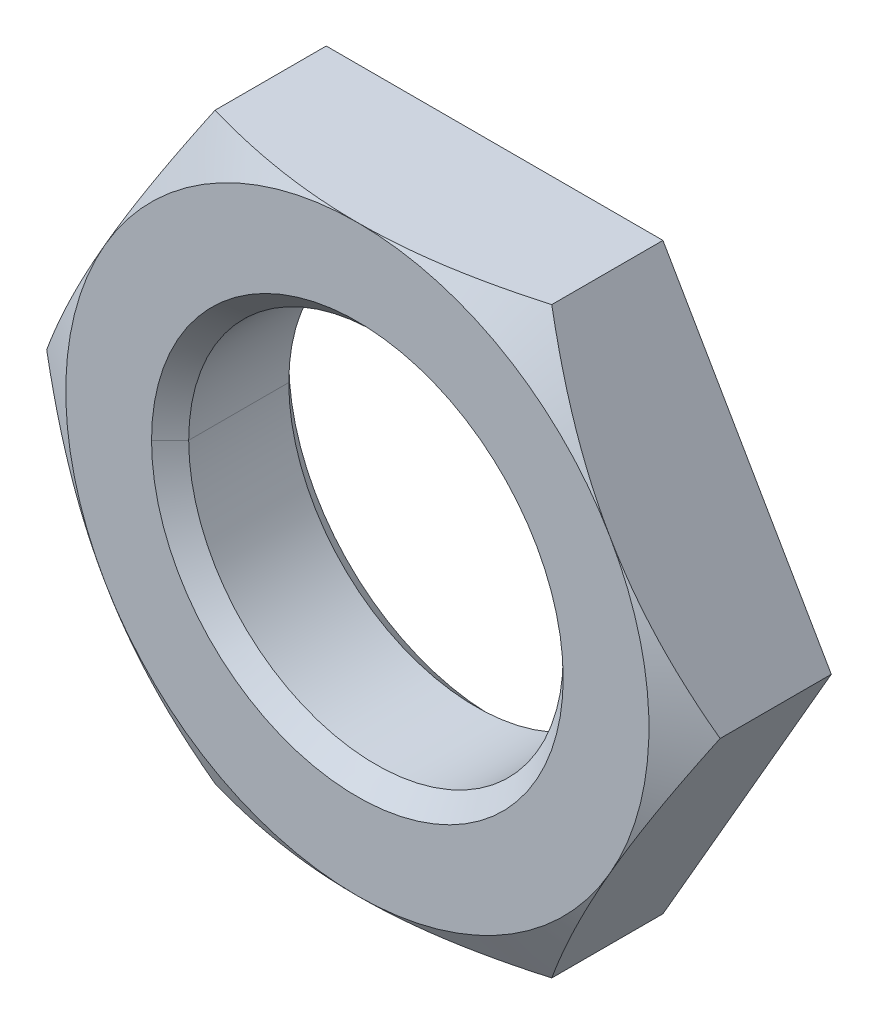
ISO-10303-21;
HEADER;
FILE_DESCRIPTION(('STEP AP214'),'2;1');
FILE_NAME('part.step','',(''),(''),'','','');
FILE_SCHEMA(('AUTOMOTIVE_DESIGN { 1 0 10303 214 1 1 1 1 }'));
ENDSEC;
DATA;
#1=APPLICATION_CONTEXT('core data for automotive mechanical design processes');
#2=APPLICATION_PROTOCOL_DEFINITION('international standard','automotive_design',2000,#1);
#3=PRODUCT_CONTEXT('',#1,'mechanical');
#4=PRODUCT('Part','Part','',(#3));
#5=PRODUCT_RELATED_PRODUCT_CATEGORY('part','',(#4));
#6=PRODUCT_DEFINITION_FORMATION('','',#4);
#7=PRODUCT_DEFINITION_CONTEXT('part definition',#1,'design');
#8=PRODUCT_DEFINITION('design','',#6,#7);
#9=PRODUCT_DEFINITION_SHAPE('','',#8);
#10=(LENGTH_UNIT() NAMED_UNIT(*) SI_UNIT(.MILLI.,.METRE.));
#11=(NAMED_UNIT(*) PLANE_ANGLE_UNIT() SI_UNIT($,.RADIAN.));
#12=(NAMED_UNIT(*) SI_UNIT($,.STERADIAN.) SOLID_ANGLE_UNIT());
#13=UNCERTAINTY_MEASURE_WITH_UNIT(LENGTH_MEASURE(1.E-05),#10,'distance_accuracy_value','');
#14=(GEOMETRIC_REPRESENTATION_CONTEXT(3) GLOBAL_UNCERTAINTY_ASSIGNED_CONTEXT((#13)) GLOBAL_UNIT_ASSIGNED_CONTEXT((#10,
#11,#12)) REPRESENTATION_CONTEXT('',''));
#15=CARTESIAN_POINT('',(0.,0.,0.));
#16=DIRECTION('',(0.,0.,1.));
#17=DIRECTION('',(1.,0.,0.));
#18=AXIS2_PLACEMENT_3D('',#15,#16,#17);
#19=CARTESIAN_POINT('',(0.,0.,4.));
#20=DIRECTION('',(0.,0.,-1.));
#21=DIRECTION('',(-0.5,-0.866025403784439,0.));
#22=AXIS2_PLACEMENT_3D('',#19,#20,#21);
#23=CONICAL_SURFACE('',#22,8.5,1.04719755119661);
#24=CARTESIAN_POINT('',(4.90736181805796,8.5002,3.24074395360206));
#25=CARTESIAN_POINT('',(5.30494305370205,7.81156909972843,3.47029568842295));
#26=CARTESIAN_POINT('',(5.71225563528683,7.10608301386154,3.66307804338871));
#27=CARTESIAN_POINT('',(6.52926879196023,5.69097471605098,3.92740251465047));
#28=CARTESIAN_POINT('',(6.94739913855476,4.96675171156286,4.));
#29=CARTESIAN_POINT('',(7.36121593216771,4.25,4.));
#30=B_SPLINE_CURVE_WITH_KNOTS('',3,(#24,#25,#26,#27,#28,#29),.UNSPECIFIED.,.F.,.F.,(4,2,4),(0.,
0.5,1.),.UNSPECIFIED.);
#31=CARTESIAN_POINT('',(4.9074772881118,8.5,3.2408106214452));
#32=VERTEX_POINT('',#31);
#33=CARTESIAN_POINT('',(7.36121593216772,4.25,4.));
#34=VERTEX_POINT('',#33);
#35=EDGE_CURVE('E11',#32,#34,#30,.T.);
#36=ORIENTED_EDGE('',*,*,#35,.F.);
#37=CARTESIAN_POINT('',(0.,8.5,4.));
#38=CARTESIAN_POINT('',(0.442406074773205,8.5,4.));
#39=CARTESIAN_POINT('',(0.894880528766715,8.5,3.97928204441104));
#40=CARTESIAN_POINT('',(2.54077283935804,8.5,3.83178715486797));
#41=CARTESIAN_POINT('',(3.74486828191635,8.5,3.5764269327898));
#42=CARTESIAN_POINT('',(4.90747728811181,8.5,3.2408106214452));
#43=B_SPLINE_CURVE_WITH_KNOTS('',3,(#37,#38,#39,#40,#41,#42),.UNSPECIFIED.,.F.,.F.,(4,2,4),(0.,
0.267721219818776,1.),.UNSPECIFIED.);
#44=CARTESIAN_POINT('',(0.,8.5,4.));
#45=VERTEX_POINT('',#44);
#46=EDGE_CURVE('E26',#45,#32,#43,.T.);
#47=ORIENTED_EDGE('',*,*,#46,.F.);
#48=CARTESIAN_POINT('',(0.,0.,4.));
#49=DIRECTION('',(0.,0.,-1.));
#50=DIRECTION('',(-1.,0.,0.));
#51=AXIS2_PLACEMENT_3D('',#48,#49,#50);
#52=CIRCLE('',#51,8.5);
#53=EDGE_CURVE('E426',#45,#34,#52,.T.);
#54=ORIENTED_EDGE('',*,*,#53,.T.);
#55=EDGE_LOOP('',(#36,#47,#54));
#56=FACE_BOUND('',#55,.T.);
#57=ADVANCED_FACE('F17',(#56),#23,.T.);
#58=CARTESIAN_POINT('',(0.,0.,4.));
#59=DIRECTION('',(0.,0.,-1.));
#60=DIRECTION('',(-1.,0.,0.));
#61=AXIS2_PLACEMENT_3D('',#58,#59,#60);
#62=PLANE('',#61);
#63=ORIENTED_EDGE('',*,*,#53,.F.);
#64=CARTESIAN_POINT('',(0.,0.,4.));
#65=DIRECTION('',(0.,0.,-1.));
#66=DIRECTION('',(-1.,0.,0.));
#67=AXIS2_PLACEMENT_3D('',#64,#65,#66);
#68=CIRCLE('',#67,8.5);
#69=CARTESIAN_POINT('',(-7.36121593216772,4.25,4.));
#70=VERTEX_POINT('',#69);
#71=EDGE_CURVE('E138',#70,#45,#68,.T.);
#72=ORIENTED_EDGE('',*,*,#71,.F.);
#73=CARTESIAN_POINT('',(0.,0.,4.));
#74=DIRECTION('',(0.,0.,-1.));
#75=DIRECTION('',(-1.,0.,0.));
#76=AXIS2_PLACEMENT_3D('',#73,#74,#75);
#77=CIRCLE('',#76,8.5);
#78=CARTESIAN_POINT('',(-7.36121593216774,-4.25,4.));
#79=VERTEX_POINT('',#78);
#80=EDGE_CURVE('E419',#79,#70,#77,.T.);
#81=ORIENTED_EDGE('',*,*,#80,.F.);
#82=CARTESIAN_POINT('',(0.,0.,4.));
#83=DIRECTION('',(0.,0.,-1.));
#84=DIRECTION('',(-1.,0.,0.));
#85=AXIS2_PLACEMENT_3D('',#82,#83,#84);
#86=CIRCLE('',#85,8.5);
#87=CARTESIAN_POINT('',(0.,-8.5,4.));
#88=VERTEX_POINT('',#87);
#89=EDGE_CURVE('E415',#88,#79,#86,.T.);
#90=ORIENTED_EDGE('',*,*,#89,.F.);
#91=CARTESIAN_POINT('',(0.,0.,4.));
#92=DIRECTION('',(0.,0.,-1.));
#93=DIRECTION('',(-1.,0.,0.));
#94=AXIS2_PLACEMENT_3D('',#91,#92,#93);
#95=CIRCLE('',#94,8.5);
#96=CARTESIAN_POINT('',(7.36121593216772,-4.25,4.));
#97=VERTEX_POINT('',#96);
#98=EDGE_CURVE('E410',#97,#88,#95,.T.);
#99=ORIENTED_EDGE('',*,*,#98,.F.);
#100=CARTESIAN_POINT('',(0.,0.,4.));
#101=DIRECTION('',(0.,0.,-1.));
#102=DIRECTION('',(-1.,0.,0.));
#103=AXIS2_PLACEMENT_3D('',#100,#101,#102);
#104=CIRCLE('',#103,8.5);
#105=EDGE_CURVE('E405',#34,#97,#104,.T.);
#106=ORIENTED_EDGE('',*,*,#105,.F.);
#107=EDGE_LOOP('',(#63,#72,#81,#90,#99,#106));
#108=FACE_BOUND('',#107,.T.);
#109=CARTESIAN_POINT('',(0.,0.,4.));
#110=DIRECTION('',(0.,0.,-1.));
#111=DIRECTION('',(-1.,0.,0.));
#112=AXIS2_PLACEMENT_3D('',#109,#110,#111);
#113=CIRCLE('',#112,6.);
#114=CARTESIAN_POINT('',(-6.,0.,4.));
#115=VERTEX_POINT('',#114);
#116=CARTESIAN_POINT('',(6.,0.,4.));
#117=VERTEX_POINT('',#116);
#118=EDGE_CURVE('E401',#115,#117,#113,.T.);
#119=ORIENTED_EDGE('',*,*,#118,.T.);
#120=CARTESIAN_POINT('',(0.,0.,4.));
#121=DIRECTION('',(0.,0.,-1.));
#122=DIRECTION('',(-1.,0.,0.));
#123=AXIS2_PLACEMENT_3D('',#120,#121,#122);
#124=CIRCLE('',#123,6.);
#125=EDGE_CURVE('E397',#117,#115,#124,.T.);
#126=ORIENTED_EDGE('',*,*,#125,.T.);
#127=EDGE_LOOP('',(#119,#126));
#128=FACE_BOUND('',#127,.T.);
#129=ADVANCED_FACE('F455',(#108,#128),#62,.F.);
#130=CARTESIAN_POINT('',(0.,0.,4.));
#131=DIRECTION('',(0.,0.,1.));
#132=DIRECTION('',(0.,1.,0.));
#133=AXIS2_PLACEMENT_3D('',#130,#131,#132);
#134=CONICAL_SURFACE('',#133,6.,0.785398163397448);
#135=DIRECTION('',(-0.707106781186548,0.,0.707106781186548));
#136=VECTOR('',#135,1.);
#137=CARTESIAN_POINT('',(-5.4585,0.,3.4585));
#138=LINE('',#137,#136);
#139=CARTESIAN_POINT('',(-5.4585,0.,3.4585));
#140=VERTEX_POINT('',#139);
#141=EDGE_CURVE('E392',#140,#115,#138,.T.);
#142=ORIENTED_EDGE('',*,*,#141,.T.);
#143=ORIENTED_EDGE('',*,*,#125,.F.);
#144=DIRECTION('',(0.707106781186548,0.,0.707106781186548));
#145=VECTOR('',#144,1.);
#146=CARTESIAN_POINT('',(5.4585,0.,3.4585));
#147=LINE('',#146,#145);
#148=CARTESIAN_POINT('',(5.4585,0.,3.4585));
#149=VERTEX_POINT('',#148);
#150=EDGE_CURVE('E387',#149,#117,#147,.T.);
#151=ORIENTED_EDGE('',*,*,#150,.F.);
#152=CARTESIAN_POINT('',(0.,0.,3.4585));
#153=DIRECTION('',(0.,0.,-1.));
#154=DIRECTION('',(-1.,0.,0.));
#155=AXIS2_PLACEMENT_3D('',#152,#153,#154);
#156=CIRCLE('',#155,5.4585);
#157=EDGE_CURVE('E383',#149,#140,#156,.T.);
#158=ORIENTED_EDGE('',*,*,#157,.T.);
#159=EDGE_LOOP('',(#142,#143,#151,#158));
#160=FACE_BOUND('',#159,.T.);
#161=ADVANCED_FACE('F545',(#160),#134,.F.);
#162=CARTESIAN_POINT('',(0.,0.,0.));
#163=DIRECTION('',(0.,0.,-1.));
#164=DIRECTION('',(-1.04482483945999E-10,1.,0.));
#165=AXIS2_PLACEMENT_3D('',#162,#163,#164);
#166=CYLINDRICAL_SURFACE('',#165,5.4585);
#167=DIRECTION('',(0.,0.,-1.));
#168=VECTOR('',#167,1.);
#169=CARTESIAN_POINT('',(5.4585,0.,3.4585));
#170=LINE('',#169,#168);
#171=CARTESIAN_POINT('',(5.4585,0.,0.5415));
#172=VERTEX_POINT('',#171);
#173=EDGE_CURVE('E379',#149,#172,#170,.T.);
#174=ORIENTED_EDGE('',*,*,#173,.T.);
#175=CARTESIAN_POINT('',(0.,0.,0.5415));
#176=DIRECTION('',(0.,0.,-1.));
#177=DIRECTION('',(-1.,0.,0.));
#178=AXIS2_PLACEMENT_3D('',#175,#176,#177);
#179=CIRCLE('',#178,5.4585);
#180=CARTESIAN_POINT('',(-5.4585,0.,0.5415));
#181=VERTEX_POINT('',#180);
#182=EDGE_CURVE('E375',#172,#181,#179,.T.);
#183=ORIENTED_EDGE('',*,*,#182,.T.);
#184=DIRECTION('',(0.,0.,-1.));
#185=VECTOR('',#184,1.);
#186=CARTESIAN_POINT('',(-5.4585,0.,3.4585));
#187=LINE('',#186,#185);
#188=EDGE_CURVE('E370',#140,#181,#187,.T.);
#189=ORIENTED_EDGE('',*,*,#188,.F.);
#190=ORIENTED_EDGE('',*,*,#157,.F.);
#191=EDGE_LOOP('',(#174,#183,#189,#190));
#192=FACE_BOUND('',#191,.T.);
#193=ADVANCED_FACE('F549',(#192),#166,.F.);
#194=CARTESIAN_POINT('',(0.,0.,0.));
#195=DIRECTION('',(0.,0.,-1.));
#196=DIRECTION('',(0.,-1.,0.));
#197=AXIS2_PLACEMENT_3D('',#194,#195,#196);
#198=CYLINDRICAL_SURFACE('',#197,5.4585);
#199=ORIENTED_EDGE('',*,*,#173,.F.);
#200=CARTESIAN_POINT('',(0.,0.,3.4585));
#201=DIRECTION('',(0.,0.,-1.));
#202=DIRECTION('',(-1.,0.,0.));
#203=AXIS2_PLACEMENT_3D('',#200,#201,#202);
#204=CIRCLE('',#203,5.4585);
#205=EDGE_CURVE('E365',#140,#149,#204,.T.);
#206=ORIENTED_EDGE('',*,*,#205,.F.);
#207=ORIENTED_EDGE('',*,*,#188,.T.);
#208=CARTESIAN_POINT('',(0.,0.,0.5415));
#209=DIRECTION('',(0.,0.,-1.));
#210=DIRECTION('',(-1.,0.,0.));
#211=AXIS2_PLACEMENT_3D('',#208,#209,#210);
#212=CIRCLE('',#211,5.4585);
#213=EDGE_CURVE('E360',#181,#172,#212,.T.);
#214=ORIENTED_EDGE('',*,*,#213,.T.);
#215=EDGE_LOOP('',(#199,#206,#207,#214));
#216=FACE_BOUND('',#215,.T.);
#217=ADVANCED_FACE('F555',(#216),#198,.F.);
#218=CARTESIAN_POINT('',(0.,0.,0.5415));
#219=DIRECTION('',(0.,0.,-1.));
#220=DIRECTION('',(0.,-1.,0.));
#221=AXIS2_PLACEMENT_3D('',#218,#219,#220);
#222=CONICAL_SURFACE('',#221,5.4585,0.785398163397449);
#223=DIRECTION('',(0.707106781186548,0.,-0.707106781186547));
#224=VECTOR('',#223,1.);
#225=CARTESIAN_POINT('',(5.4585,0.,0.541500000000001));
#226=LINE('',#225,#224);
#227=CARTESIAN_POINT('',(6.,0.,0.));
#228=VERTEX_POINT('',#227);
#229=EDGE_CURVE('E355',#172,#228,#226,.T.);
#230=ORIENTED_EDGE('',*,*,#229,.F.);
#231=ORIENTED_EDGE('',*,*,#213,.F.);
#232=DIRECTION('',(-0.707106781186548,0.,-0.707106781186547));
#233=VECTOR('',#232,1.);
#234=CARTESIAN_POINT('',(-5.4585,0.,0.541500000000001));
#235=LINE('',#234,#233);
#236=CARTESIAN_POINT('',(-6.,0.,0.));
#237=VERTEX_POINT('',#236);
#238=EDGE_CURVE('E351',#181,#237,#235,.T.);
#239=ORIENTED_EDGE('',*,*,#238,.T.);
#240=CARTESIAN_POINT('',(0.,0.,0.));
#241=DIRECTION('',(0.,0.,-1.));
#242=DIRECTION('',(-1.,0.,0.));
#243=AXIS2_PLACEMENT_3D('',#240,#241,#242);
#244=CIRCLE('',#243,6.);
#245=EDGE_CURVE('E347',#237,#228,#244,.T.);
#246=ORIENTED_EDGE('',*,*,#245,.T.);
#247=EDGE_LOOP('',(#230,#231,#239,#246));
#248=FACE_BOUND('',#247,.T.);
#249=ADVANCED_FACE('F559',(#248),#222,.F.);
#250=CARTESIAN_POINT('',(0.,9.8149545762236,0.));
#251=DIRECTION('',(0.,0.,1.));
#252=DIRECTION('',(1.,0.,0.));
#253=AXIS2_PLACEMENT_3D('',#250,#251,#252);
#254=PLANE('',#253);
#255=CARTESIAN_POINT('',(0.,0.,0.));
#256=DIRECTION('',(0.,0.,-1.));
#257=DIRECTION('',(-1.,0.,0.));
#258=AXIS2_PLACEMENT_3D('',#255,#256,#257);
#259=CIRCLE('',#258,6.);
#260=EDGE_CURVE('E342',#228,#237,#259,.T.);
#261=ORIENTED_EDGE('',*,*,#260,.F.);
#262=ORIENTED_EDGE('',*,*,#245,.F.);
#263=EDGE_LOOP('',(#261,#262));
#264=FACE_BOUND('',#263,.T.);
#265=DIRECTION('',(0.499999999999999,0.866025403784439,0.));
#266=VECTOR('',#265,1.);
#267=CARTESIAN_POINT('',(-9.8149545762236,0.,0.));
#268=LINE('',#267,#266);
#269=CARTESIAN_POINT('',(-9.8149545762236,0.,0.));
#270=VERTEX_POINT('',#269);
#271=CARTESIAN_POINT('',(-4.9074772881118,8.5,0.));
#272=VERTEX_POINT('',#271);
#273=EDGE_CURVE('E338',#270,#272,#268,.T.);
#274=ORIENTED_EDGE('',*,*,#273,.T.);
#275=DIRECTION('',(-1.,0.,0.));
#276=VECTOR('',#275,1.);
#277=CARTESIAN_POINT('',(0.,8.5,0.));
#278=LINE('',#277,#276);
#279=CARTESIAN_POINT('',(4.9074772881118,8.5,0.));
#280=VERTEX_POINT('',#279);
#281=EDGE_CURVE('E118',#280,#272,#278,.T.);
#282=ORIENTED_EDGE('',*,*,#281,.F.);
#283=DIRECTION('',(0.499999999999999,-0.866025403784439,0.));
#284=VECTOR('',#283,1.);
#285=CARTESIAN_POINT('',(4.9074772881118,8.5,0.));
#286=LINE('',#285,#284);
#287=CARTESIAN_POINT('',(9.8149545762236,0.,0.));
#288=VERTEX_POINT('',#287);
#289=EDGE_CURVE('E331',#280,#288,#286,.T.);
#290=ORIENTED_EDGE('',*,*,#289,.T.);
#291=DIRECTION('',(-0.499999999999999,-0.866025403784439,0.));
#292=VECTOR('',#291,1.);
#293=CARTESIAN_POINT('',(9.8149545762236,0.,0.));
#294=LINE('',#293,#292);
#295=CARTESIAN_POINT('',(4.9074772881118,-8.5,0.));
#296=VERTEX_POINT('',#295);
#297=EDGE_CURVE('E327',#288,#296,#294,.T.);
#298=ORIENTED_EDGE('',*,*,#297,.T.);
#299=DIRECTION('',(-1.,0.,0.));
#300=VECTOR('',#299,1.);
#301=CARTESIAN_POINT('',(4.9074772881118,-8.5,0.));
#302=LINE('',#301,#300);
#303=CARTESIAN_POINT('',(-4.9074772881118,-8.5,0.));
#304=VERTEX_POINT('',#303);
#305=EDGE_CURVE('E323',#296,#304,#302,.T.);
#306=ORIENTED_EDGE('',*,*,#305,.T.);
#307=DIRECTION('',(-0.499999999999999,0.866025403784439,0.));
#308=VECTOR('',#307,1.);
#309=CARTESIAN_POINT('',(-4.9074772881118,-8.5,0.));
#310=LINE('',#309,#308);
#311=EDGE_CURVE('E321',#304,#270,#310,.T.);
#312=ORIENTED_EDGE('',*,*,#311,.T.);
#313=EDGE_LOOP('',(#274,#282,#290,#298,#306,#312));
#314=FACE_BOUND('',#313,.T.);
#315=ADVANCED_FACE('F507',(#264,#314),#254,.F.);
#316=CARTESIAN_POINT('',(-4.9074772881118,-8.5,4.));
#317=DIRECTION('',(-0.866025403784439,-0.499999999999999,0.));
#318=DIRECTION('',(0.499999999999999,-0.866025403784439,0.));
#319=AXIS2_PLACEMENT_3D('',#316,#317,#318);
#320=PLANE('',#319);
#321=CARTESIAN_POINT('',(-4.90736181805796,-8.5002,3.24074395360206));
#322=CARTESIAN_POINT('',(-5.30494305370205,-7.81156909972843,3.47029568842295));
#323=CARTESIAN_POINT('',(-5.71225563528683,-7.10608301386154,3.66307804338871));
#324=CARTESIAN_POINT('',(-6.52926879196023,-5.69097471605097,3.92740251465047));
#325=CARTESIAN_POINT('',(-6.94739913855477,-4.96675171156285,4.));
#326=CARTESIAN_POINT('',(-7.36121593216771,-4.24999999999999,4.));
#327=B_SPLINE_CURVE_WITH_KNOTS('',3,(#321,#322,#323,#324,#325,#326),.UNSPECIFIED.,.F.,.F.,(4,2,
4),(0.,0.5,1.),.UNSPECIFIED.);
#328=CARTESIAN_POINT('',(-4.9074772881118,-8.5,3.2408106214452));
#329=VERTEX_POINT('',#328);
#330=EDGE_CURVE('E319',#329,#79,#327,.T.);
#331=ORIENTED_EDGE('',*,*,#330,.T.);
#332=CARTESIAN_POINT('',(-7.36121593216771,-4.24999999999999,4.));
#333=CARTESIAN_POINT('',(-7.41868881250727,-4.15045405119456,4.));
#334=CARTESIAN_POINT('',(-7.47824461257094,-4.04730037959885,3.99858739502237));
#335=CARTESIAN_POINT('',(-7.92066463055134,-3.28100643017128,3.97763137910949));
#336=CARTESIAN_POINT('',(-8.30816451224056,-2.6098369471586,3.89709120545195));
#337=CARTESIAN_POINT('',(-9.06716027776796,-1.29521771853551,3.6359802180229));
#338=CARTESIAN_POINT('',(-9.44510661092583,-0.640595466971731,3.45434998122981));
#339=CARTESIAN_POINT('',(-9.81507004627744,0.000199999999990139,3.24074395360208));
#340=B_SPLINE_CURVE_WITH_KNOTS('',3,(#332,#333,#334,#335,#336,#337,#338,#339),.UNSPECIFIED.,.F.,
.F.,(4,2,2,4),(0.,0.0694439578772033,0.534721978938602,1.),.UNSPECIFIED.);
#341=CARTESIAN_POINT('',(-9.8149545762236,0.,3.2408106214452));
#342=VERTEX_POINT('',#341);
#343=EDGE_CURVE('E294',#79,#342,#340,.T.);
#344=ORIENTED_EDGE('',*,*,#343,.T.);
#345=DIRECTION('',(0.,0.,-1.));
#346=VECTOR('',#345,1.);
#347=CARTESIAN_POINT('',(-9.8149545762236,0.,4.));
#348=LINE('',#347,#346);
#349=EDGE_CURVE('E289',#342,#270,#348,.T.);
#350=ORIENTED_EDGE('',*,*,#349,.T.);
#351=ORIENTED_EDGE('',*,*,#311,.F.);
#352=DIRECTION('',(0.,0.,-1.));
#353=VECTOR('',#352,1.);
#354=CARTESIAN_POINT('',(-4.9074772881118,-8.5,4.));
#355=LINE('',#354,#353);
#356=EDGE_CURVE('E286',#329,#304,#355,.T.);
#357=ORIENTED_EDGE('',*,*,#356,.F.);
#358=EDGE_LOOP('',(#331,#344,#350,#351,#357));
#359=FACE_BOUND('',#358,.T.);
#360=ADVANCED_FACE('F270',(#359),#320,.T.);
#361=CARTESIAN_POINT('',(4.9074772881118,-8.5,4.));
#362=DIRECTION('',(0.,-1.,0.));
#363=DIRECTION('',(0.,0.,-1.));
#364=AXIS2_PLACEMENT_3D('',#361,#362,#363);
#365=PLANE('',#364);
#366=CARTESIAN_POINT('',(4.9074772881118,-8.5,3.2408106214452));
#367=CARTESIAN_POINT('',(3.74486828191634,-8.5,3.5764269327898));
#368=CARTESIAN_POINT('',(2.54077283935804,-8.5,3.83178715486797));
#369=CARTESIAN_POINT('',(0.894880528766716,-8.5,3.97928204441104));
#370=CARTESIAN_POINT('',(0.442406074773205,-8.5,4.));
#371=CARTESIAN_POINT('',(0.,-8.5,4.));
#372=B_SPLINE_CURVE_WITH_KNOTS('',3,(#366,#367,#368,#369,#370,#371),.UNSPECIFIED.,.F.,.F.,(4,2,
4),(0.,0.732278780181224,1.),.UNSPECIFIED.);
#373=CARTESIAN_POINT('',(4.9074772881118,-8.5,3.2408106214452));
#374=VERTEX_POINT('',#373);
#375=EDGE_CURVE('E285',#374,#88,#372,.T.);
#376=ORIENTED_EDGE('',*,*,#375,.T.);
#377=CARTESIAN_POINT('',(0.,-8.5,4.));
#378=CARTESIAN_POINT('',(-0.61497754362781,-8.5,4.));
#379=CARTESIAN_POINT('',(-1.23570252251525,-8.5,3.9603857983385));
#380=CARTESIAN_POINT('',(-2.45652611218222,-8.5,3.81078874095217));
#381=CARTESIAN_POINT('',(-3.06787503956826,-8.5,3.69982700901266));
#382=CARTESIAN_POINT('',(-4.08086947194619,-8.5,3.46813453496189));
#383=CARTESIAN_POINT('',(-4.49994261545497,-8.5,3.35845574792646));
#384=CARTESIAN_POINT('',(-4.9074772881118,-8.5,3.2408106214452));
#385=B_SPLINE_CURVE_WITH_KNOTS('',3,(#377,#378,#379,#380,#381,#382,#383,#384),.UNSPECIFIED.,.F.,
.F.,(4,2,2,4),(0.,0.371782938446638,0.743565876893277,1.),.UNSPECIFIED.);
#386=EDGE_CURVE('E253',#88,#329,#385,.T.);
#387=ORIENTED_EDGE('',*,*,#386,.T.);
#388=ORIENTED_EDGE('',*,*,#356,.T.);
#389=ORIENTED_EDGE('',*,*,#305,.F.);
#390=DIRECTION('',(0.,0.,-1.));
#391=VECTOR('',#390,1.);
#392=CARTESIAN_POINT('',(4.9074772881118,-8.5,4.));
#393=LINE('',#392,#391);
#394=EDGE_CURVE('E251',#374,#296,#393,.T.);
#395=ORIENTED_EDGE('',*,*,#394,.F.);
#396=EDGE_LOOP('',(#376,#387,#388,#389,#395));
#397=FACE_BOUND('',#396,.T.);
#398=ADVANCED_FACE('F261',(#397),#365,.T.);
#399=CARTESIAN_POINT('',(9.8149545762236,0.,4.));
#400=DIRECTION('',(0.866025403784439,-0.499999999999999,0.));
#401=DIRECTION('',(0.499999999999999,0.866025403784439,0.));
#402=AXIS2_PLACEMENT_3D('',#399,#400,#401);
#403=PLANE('',#402);
#404=CARTESIAN_POINT('',(9.81507004627744,0.00020000000000195,3.24074395360208));
#405=CARTESIAN_POINT('',(9.41748881063336,-0.688430900271565,3.47029568842296));
#406=CARTESIAN_POINT('',(9.01017622904857,-1.39391698613846,3.66307804338872));
#407=CARTESIAN_POINT('',(8.19316307237518,-2.80902528394901,3.92740251465047));
#408=CARTESIAN_POINT('',(7.77503272578064,-3.53324828843713,4.));
#409=CARTESIAN_POINT('',(7.36121593216771,-4.24999999999998,4.));
#410=B_SPLINE_CURVE_WITH_KNOTS('',3,(#404,#405,#406,#407,#408,#409),.UNSPECIFIED.,.F.,.F.,(4,2,
4),(0.,0.5,1.),.UNSPECIFIED.);
#411=CARTESIAN_POINT('',(9.8149545762236,0.,3.2408106214452));
#412=VERTEX_POINT('',#411);
#413=EDGE_CURVE('E250',#412,#97,#410,.T.);
#414=ORIENTED_EDGE('',*,*,#413,.T.);
#415=CARTESIAN_POINT('',(7.3612159321677,-4.24999999999998,4.));
#416=CARTESIAN_POINT('',(7.30374305182815,-4.34954594880542,4.));
#417=CARTESIAN_POINT('',(7.24418725176447,-4.45269962040113,3.99858739502237));
#418=CARTESIAN_POINT('',(6.80176723378407,-5.21899356982872,3.97763137910948));
#419=CARTESIAN_POINT('',(6.41426735209484,-5.89016305284139,3.89709120545195));
#420=CARTESIAN_POINT('',(5.65527158656744,-7.20478228146449,3.63598021802289));
#421=CARTESIAN_POINT('',(5.27732525340958,-7.85940453302826,3.45434998122979));
#422=CARTESIAN_POINT('',(4.90736181805796,-8.50019999999998,3.24074395360206));
#423=B_SPLINE_CURVE_WITH_KNOTS('',3,(#415,#416,#417,#418,#419,#420,#421,#422),.UNSPECIFIED.,.F.,
.F.,(4,2,2,4),(0.,0.069443957877206,0.534721978938603,1.),.UNSPECIFIED.);
#424=EDGE_CURVE('E222',#97,#374,#423,.T.);
#425=ORIENTED_EDGE('',*,*,#424,.T.);
#426=ORIENTED_EDGE('',*,*,#394,.T.);
#427=ORIENTED_EDGE('',*,*,#297,.F.);
#428=DIRECTION('',(0.,0.,-1.));
#429=VECTOR('',#428,1.);
#430=CARTESIAN_POINT('',(9.8149545762236,0.,4.));
#431=LINE('',#430,#429);
#432=EDGE_CURVE('E219',#412,#288,#431,.T.);
#433=ORIENTED_EDGE('',*,*,#432,.F.);
#434=EDGE_LOOP('',(#414,#425,#426,#427,#433));
#435=FACE_BOUND('',#434,.T.);
#436=ADVANCED_FACE('F205',(#435),#403,.T.);
#437=CARTESIAN_POINT('',(4.9074772881118,8.5,4.));
#438=DIRECTION('',(0.866025403784439,0.499999999999999,0.));
#439=DIRECTION('',(-0.499999999999999,0.866025403784439,0.));
#440=AXIS2_PLACEMENT_3D('',#437,#438,#439);
#441=PLANE('',#440);
#442=ORIENTED_EDGE('',*,*,#35,.T.);
#443=CARTESIAN_POINT('',(7.36121593216771,4.25,4.));
#444=CARTESIAN_POINT('',(7.41868881250726,4.15045405119456,4.));
#445=CARTESIAN_POINT('',(7.47824461257094,4.04730037959886,3.99858739502237));
#446=CARTESIAN_POINT('',(7.92066463055134,3.28100643017128,3.97763137910949));
#447=CARTESIAN_POINT('',(8.30816451224056,2.6098369471586,3.89709120545195));
#448=CARTESIAN_POINT('',(9.06716027776796,1.29521771853551,3.6359802180229));
#449=CARTESIAN_POINT('',(9.44510661092583,0.640595466971731,3.45434998122981));
#450=CARTESIAN_POINT('',(9.81507004627744,-0.000199999999990139,3.24074395360208));
#451=B_SPLINE_CURVE_WITH_KNOTS('',3,(#443,#444,#445,#446,#447,#448,#449,#450),.UNSPECIFIED.,.F.,
.F.,(4,2,2,4),(0.,0.0694439578772051,0.534721978938603,1.),.UNSPECIFIED.);
#452=EDGE_CURVE('E188',#34,#412,#451,.T.);
#453=ORIENTED_EDGE('',*,*,#452,.T.);
#454=ORIENTED_EDGE('',*,*,#432,.T.);
#455=ORIENTED_EDGE('',*,*,#289,.F.);
#456=DIRECTION('',(0.,0.,-1.));
#457=VECTOR('',#456,1.);
#458=CARTESIAN_POINT('',(4.9074772881118,8.5,4.));
#459=LINE('',#458,#457);
#460=EDGE_CURVE('E139',#32,#280,#459,.T.);
#461=ORIENTED_EDGE('',*,*,#460,.F.);
#462=EDGE_LOOP('',(#442,#453,#454,#455,#461));
#463=FACE_BOUND('',#462,.T.);
#464=ADVANCED_FACE('F196',(#463),#441,.T.);
#465=CARTESIAN_POINT('',(-4.9074772881118,8.5,4.));
#466=DIRECTION('',(0.,1.,0.));
#467=DIRECTION('',(0.,0.,1.));
#468=AXIS2_PLACEMENT_3D('',#465,#466,#467);
#469=PLANE('',#468);
#470=CARTESIAN_POINT('',(-4.9074772881118,8.5,3.2408106214452));
#471=CARTESIAN_POINT('',(-4.49994261545497,8.5,3.35845574792646));
#472=CARTESIAN_POINT('',(-4.08086947194619,8.5,3.46813453496189));
#473=CARTESIAN_POINT('',(-3.06787503956826,8.5,3.69982700901266));
#474=CARTESIAN_POINT('',(-2.45652611218222,8.5,3.81078874095217));
#475=CARTESIAN_POINT('',(-1.23570252251525,8.5,3.9603857983385));
#476=CARTESIAN_POINT('',(-0.614977543627809,8.5,4.));
#477=CARTESIAN_POINT('',(0.,8.5,4.));
#478=B_SPLINE_CURVE_WITH_KNOTS('',3,(#470,#471,#472,#473,#474,#475,#476,#477),.UNSPECIFIED.,.F.,
.F.,(4,2,2,4),(0.,0.256434123106723,0.628217061553362,1.),.UNSPECIFIED.);
#479=CARTESIAN_POINT('',(-4.9074772881118,8.5,3.2408106214452));
#480=VERTEX_POINT('',#479);
#481=EDGE_CURVE('E114',#480,#45,#478,.T.);
#482=ORIENTED_EDGE('',*,*,#481,.T.);
#483=ORIENTED_EDGE('',*,*,#46,.T.);
#484=ORIENTED_EDGE('',*,*,#460,.T.);
#485=ORIENTED_EDGE('',*,*,#281,.T.);
#486=DIRECTION('',(0.,0.,-1.));
#487=VECTOR('',#486,1.);
#488=CARTESIAN_POINT('',(-4.9074772881118,8.5,4.));
#489=LINE('',#488,#487);
#490=EDGE_CURVE('E110',#480,#272,#489,.T.);
#491=ORIENTED_EDGE('',*,*,#490,.F.);
#492=EDGE_LOOP('',(#482,#483,#484,#485,#491));
#493=FACE_BOUND('',#492,.T.);
#494=ADVANCED_FACE('F112',(#493),#469,.T.);
#495=CARTESIAN_POINT('',(-9.8149545762236,0.,4.));
#496=DIRECTION('',(-0.866025403784439,0.499999999999999,0.));
#497=DIRECTION('',(-0.499999999999999,-0.866025403784439,0.));
#498=AXIS2_PLACEMENT_3D('',#495,#496,#497);
#499=PLANE('',#498);
#500=CARTESIAN_POINT('',(-9.81507004627744,-0.00020000000000195,3.24074395360208));
#501=CARTESIAN_POINT('',(-9.41748881063336,0.688430900271565,3.47029568842296));
#502=CARTESIAN_POINT('',(-9.01017622904857,1.39391698613846,3.66307804338872));
#503=CARTESIAN_POINT('',(-8.19316307237518,2.80902528394901,3.92740251465047));
#504=CARTESIAN_POINT('',(-7.77503272578064,3.53324828843713,4.));
#505=CARTESIAN_POINT('',(-7.36121593216771,4.24999999999998,4.));
#506=B_SPLINE_CURVE_WITH_KNOTS('',3,(#500,#501,#502,#503,#504,#505),.UNSPECIFIED.,.F.,.F.,(4,2,
4),(0.,0.5,1.),.UNSPECIFIED.);
#507=EDGE_CURVE('E121',#342,#70,#506,.T.);
#508=ORIENTED_EDGE('',*,*,#507,.T.);
#509=CARTESIAN_POINT('',(-7.3612159321677,4.24999999999998,4.));
#510=CARTESIAN_POINT('',(-7.30374305182815,4.34954594880542,4.));
#511=CARTESIAN_POINT('',(-7.24418725176447,4.45269962040113,3.99858739502237));
#512=CARTESIAN_POINT('',(-6.80176723378407,5.21899356982872,3.97763137910948));
#513=CARTESIAN_POINT('',(-6.41426735209484,5.89016305284139,3.89709120545195));
#514=CARTESIAN_POINT('',(-5.65527158656744,7.20478228146449,3.63598021802289));
#515=CARTESIAN_POINT('',(-5.27732525340958,7.85940453302826,3.45434998122979));
#516=CARTESIAN_POINT('',(-4.90736181805796,8.50019999999998,3.24074395360206));
#517=B_SPLINE_CURVE_WITH_KNOTS('',3,(#509,#510,#511,#512,#513,#514,#515,#516),.UNSPECIFIED.,.F.,
.F.,(4,2,2,4),(0.,0.069443957877206,0.534721978938603,1.),.UNSPECIFIED.);
#518=EDGE_CURVE('E125',#70,#480,#517,.T.);
#519=ORIENTED_EDGE('',*,*,#518,.T.);
#520=ORIENTED_EDGE('',*,*,#490,.T.);
#521=ORIENTED_EDGE('',*,*,#273,.F.);
#522=ORIENTED_EDGE('',*,*,#349,.F.);
#523=EDGE_LOOP('',(#508,#519,#520,#521,#522));
#524=FACE_BOUND('',#523,.T.);
#525=ADVANCED_FACE('F127',(#524),#499,.T.);
#526=CARTESIAN_POINT('',(0.,0.,4.));
#527=DIRECTION('',(0.,0.,-1.));
#528=DIRECTION('',(0.5,-0.866025403784439,0.));
#529=AXIS2_PLACEMENT_3D('',#526,#527,#528);
#530=CONICAL_SURFACE('',#529,8.5,1.04719755119661);
#531=ORIENTED_EDGE('',*,*,#481,.F.);
#532=ORIENTED_EDGE('',*,*,#518,.F.);
#533=ORIENTED_EDGE('',*,*,#71,.T.);
#534=EDGE_LOOP('',(#531,#532,#533));
#535=FACE_BOUND('',#534,.T.);
#536=ADVANCED_FACE('F137',(#535),#530,.T.);
#537=CARTESIAN_POINT('',(0.,0.,4.));
#538=DIRECTION('',(0.,0.,-1.));
#539=DIRECTION('',(1.,0.,0.));
#540=AXIS2_PLACEMENT_3D('',#537,#538,#539);
#541=CONICAL_SURFACE('',#540,8.5,1.04719755119661);
#542=ORIENTED_EDGE('',*,*,#507,.F.);
#543=ORIENTED_EDGE('',*,*,#343,.F.);
#544=ORIENTED_EDGE('',*,*,#80,.T.);
#545=EDGE_LOOP('',(#542,#543,#544));
#546=FACE_BOUND('',#545,.T.);
#547=ADVANCED_FACE('F477',(#546),#541,.T.);
#548=CARTESIAN_POINT('',(0.,0.,4.));
#549=DIRECTION('',(0.,0.,-1.));
#550=DIRECTION('',(-1.,0.,0.));
#551=AXIS2_PLACEMENT_3D('',#548,#549,#550);
#552=CONICAL_SURFACE('',#551,8.5,1.04719755119661);
#553=ORIENTED_EDGE('',*,*,#452,.F.);
#554=ORIENTED_EDGE('',*,*,#105,.T.);
#555=ORIENTED_EDGE('',*,*,#413,.F.);
#556=EDGE_LOOP('',(#553,#554,#555));
#557=FACE_BOUND('',#556,.T.);
#558=ADVANCED_FACE('F451',(#557),#552,.T.);
#559=CARTESIAN_POINT('',(0.,0.,4.));
#560=DIRECTION('',(0.,0.,-1.));
#561=DIRECTION('',(-0.5,0.866025403784439,0.));
#562=AXIS2_PLACEMENT_3D('',#559,#560,#561);
#563=CONICAL_SURFACE('',#562,8.5,1.04719755119661);
#564=ORIENTED_EDGE('',*,*,#424,.F.);
#565=ORIENTED_EDGE('',*,*,#98,.T.);
#566=ORIENTED_EDGE('',*,*,#375,.F.);
#567=EDGE_LOOP('',(#564,#565,#566));
#568=FACE_BOUND('',#567,.T.);
#569=ADVANCED_FACE('F460',(#568),#563,.T.);
#570=CARTESIAN_POINT('',(0.,0.,4.));
#571=DIRECTION('',(0.,0.,-1.));
#572=DIRECTION('',(0.499999999999999,0.866025403784439,0.));
#573=AXIS2_PLACEMENT_3D('',#570,#571,#572);
#574=CONICAL_SURFACE('',#573,8.5,1.04719755119661);
#575=ORIENTED_EDGE('',*,*,#386,.F.);
#576=ORIENTED_EDGE('',*,*,#89,.T.);
#577=ORIENTED_EDGE('',*,*,#330,.F.);
#578=EDGE_LOOP('',(#575,#576,#577));
#579=FACE_BOUND('',#578,.T.);
#580=ADVANCED_FACE('F513',(#579),#574,.T.);
#581=CARTESIAN_POINT('',(0.,0.,0.5415));
#582=DIRECTION('',(0.,0.,-1.));
#583=DIRECTION('',(0.,1.,0.));
#584=AXIS2_PLACEMENT_3D('',#581,#582,#583);
#585=CONICAL_SURFACE('',#584,5.4585,0.785398163397449);
#586=ORIENTED_EDGE('',*,*,#229,.T.);
#587=ORIENTED_EDGE('',*,*,#260,.T.);
#588=ORIENTED_EDGE('',*,*,#238,.F.);
#589=ORIENTED_EDGE('',*,*,#182,.F.);
#590=EDGE_LOOP('',(#586,#587,#588,#589));
#591=FACE_BOUND('',#590,.T.);
#592=ADVANCED_FACE('F529',(#591),#585,.F.);
#593=CARTESIAN_POINT('',(0.,0.,4.));
#594=DIRECTION('',(0.,0.,1.));
#595=DIRECTION('',(0.,-1.,0.));
#596=AXIS2_PLACEMENT_3D('',#593,#594,#595);
#597=CONICAL_SURFACE('',#596,6.,0.785398163397448);
#598=ORIENTED_EDGE('',*,*,#141,.F.);
#599=ORIENTED_EDGE('',*,*,#205,.T.);
#600=ORIENTED_EDGE('',*,*,#150,.T.);
#601=ORIENTED_EDGE('',*,*,#118,.F.);
#602=EDGE_LOOP('',(#598,#599,#600,#601));
#603=FACE_BOUND('',#602,.T.);
#604=ADVANCED_FACE('F533',(#603),#597,.F.);
#605=CLOSED_SHELL('',(#57,#129,#161,#193,#217,#249,#315,#360,#398,#436,#464,#494,#525,#536,#547,
#558,#569,#580,#592,#604));
#606=MANIFOLD_SOLID_BREP('B1',#605);
#607=ADVANCED_BREP_SHAPE_REPRESENTATION('',(#18,#606),#14);
#608=SHAPE_DEFINITION_REPRESENTATION(#9,#607);
ENDSEC;
END-ISO-10303-21;
